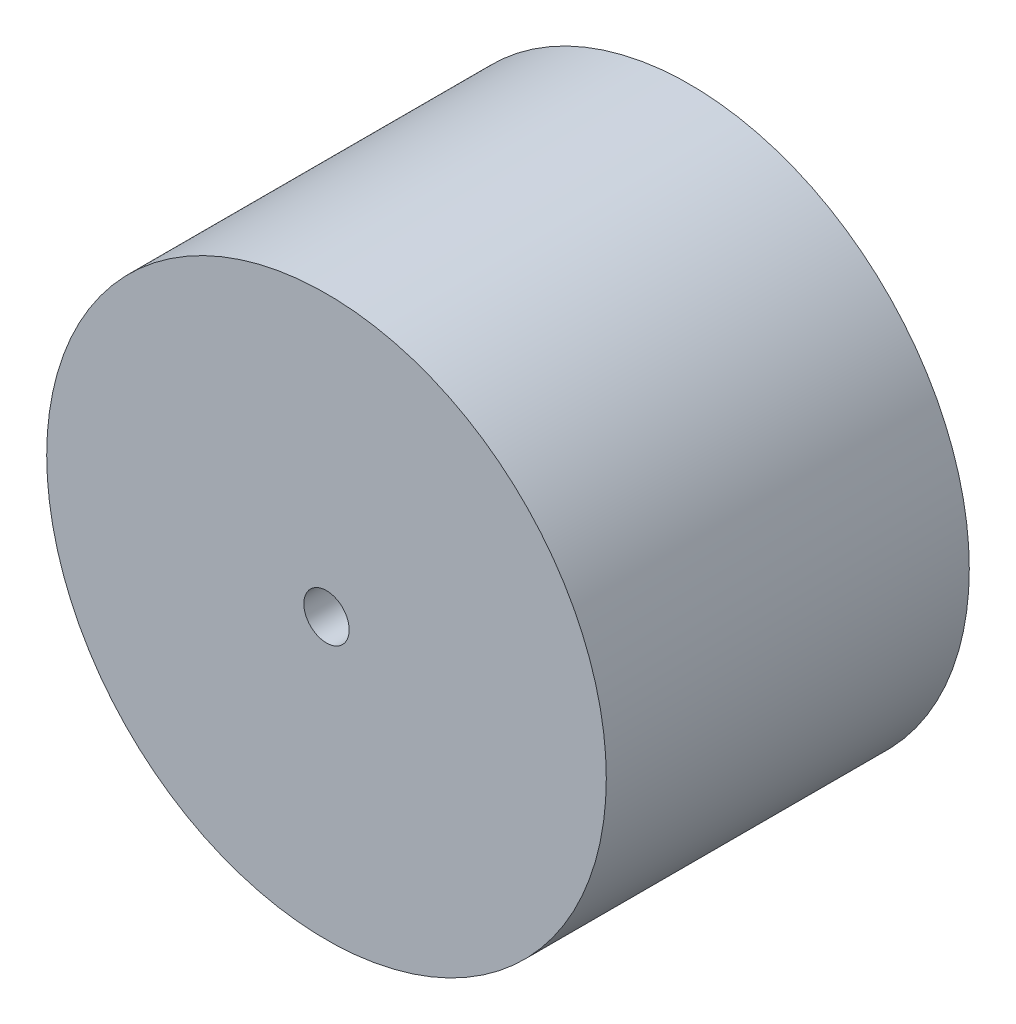
ISO-10303-21;
HEADER;
FILE_DESCRIPTION(('STEP AP214'),'2;1');
FILE_NAME('part.step','',(''),(''),'','','');
FILE_SCHEMA(('AUTOMOTIVE_DESIGN { 1 0 10303 214 1 1 1 1 }'));
ENDSEC;
DATA;
#1=APPLICATION_CONTEXT('core data for automotive mechanical design processes');
#2=APPLICATION_PROTOCOL_DEFINITION('international standard','automotive_design',2000,#1);
#3=PRODUCT_CONTEXT('',#1,'mechanical');
#4=PRODUCT('Part','Part','',(#3));
#5=PRODUCT_RELATED_PRODUCT_CATEGORY('part','',(#4));
#6=PRODUCT_DEFINITION_FORMATION('','',#4);
#7=PRODUCT_DEFINITION_CONTEXT('part definition',#1,'design');
#8=PRODUCT_DEFINITION('design','',#6,#7);
#9=PRODUCT_DEFINITION_SHAPE('','',#8);
#10=(LENGTH_UNIT() NAMED_UNIT(*) SI_UNIT(.MILLI.,.METRE.));
#11=(NAMED_UNIT(*) PLANE_ANGLE_UNIT() SI_UNIT($,.RADIAN.));
#12=(NAMED_UNIT(*) SI_UNIT($,.STERADIAN.) SOLID_ANGLE_UNIT());
#13=UNCERTAINTY_MEASURE_WITH_UNIT(LENGTH_MEASURE(1.E-05),#10,'distance_accuracy_value','');
#14=(GEOMETRIC_REPRESENTATION_CONTEXT(3) GLOBAL_UNCERTAINTY_ASSIGNED_CONTEXT((#13)) GLOBAL_UNIT_ASSIGNED_CONTEXT((#10,
#11,#12)) REPRESENTATION_CONTEXT('',''));
#15=CARTESIAN_POINT('',(0.,0.,0.));
#16=DIRECTION('',(0.,0.,1.));
#17=DIRECTION('',(1.,0.,0.));
#18=AXIS2_PLACEMENT_3D('',#15,#16,#17);
#19=CARTESIAN_POINT('',(0.,0.,24.));
#20=DIRECTION('',(0.,0.,-1.));
#21=DIRECTION('',(-1.,0.,0.));
#22=AXIS2_PLACEMENT_3D('',#19,#20,#21);
#23=CYLINDRICAL_SURFACE('',#22,18.5);
#24=CARTESIAN_POINT('',(0.,0.,24.));
#25=DIRECTION('',(0.,0.,1.));
#26=DIRECTION('',(1.,0.,0.));
#27=AXIS2_PLACEMENT_3D('',#24,#25,#26);
#28=CIRCLE('',#27,18.5);
#29=CARTESIAN_POINT('',(18.5,0.,24.));
#30=VERTEX_POINT('',#29);
#31=EDGE_CURVE('E10',#30,#30,#28,.T.);
#32=ORIENTED_EDGE('',*,*,#31,.F.);
#33=EDGE_LOOP('',(#32));
#34=FACE_BOUND('',#33,.T.);
#35=CARTESIAN_POINT('',(0.,0.,0.));
#36=DIRECTION('',(0.,0.,1.));
#37=DIRECTION('',(1.,0.,0.));
#38=AXIS2_PLACEMENT_3D('',#35,#36,#37);
#39=CIRCLE('',#38,18.5);
#40=CARTESIAN_POINT('',(18.5,0.,0.));
#41=VERTEX_POINT('',#40);
#42=EDGE_CURVE('E36',#41,#41,#39,.T.);
#43=ORIENTED_EDGE('',*,*,#42,.T.);
#44=EDGE_LOOP('',(#43));
#45=FACE_BOUND('',#44,.T.);
#46=ADVANCED_FACE('F33',(#34,#45),#23,.T.);
#47=CARTESIAN_POINT('',(0.,0.,24.));
#48=DIRECTION('',(0.,0.,1.));
#49=DIRECTION('',(1.,0.,0.));
#50=AXIS2_PLACEMENT_3D('',#47,#48,#49);
#51=PLANE('',#50);
#52=CARTESIAN_POINT('',(0.,0.,24.));
#53=DIRECTION('',(0.,0.,1.));
#54=DIRECTION('',(1.,0.,0.));
#55=AXIS2_PLACEMENT_3D('',#52,#53,#54);
#56=CIRCLE('',#55,1.5);
#57=CARTESIAN_POINT('',(1.5,0.,24.));
#58=VERTEX_POINT('',#57);
#59=EDGE_CURVE('E45',#58,#58,#56,.T.);
#60=ORIENTED_EDGE('',*,*,#59,.F.);
#61=EDGE_LOOP('',(#60));
#62=FACE_BOUND('',#61,.T.);
#63=ORIENTED_EDGE('',*,*,#31,.T.);
#64=EDGE_LOOP('',(#63));
#65=FACE_BOUND('',#64,.T.);
#66=ADVANCED_FACE('F60',(#62,#65),#51,.T.);
#67=CARTESIAN_POINT('',(0.,0.,0.));
#68=DIRECTION('',(0.,0.,1.));
#69=DIRECTION('',(1.,0.,0.));
#70=AXIS2_PLACEMENT_3D('',#67,#68,#69);
#71=PLANE('',#70);
#72=CARTESIAN_POINT('',(0.,0.,0.));
#73=DIRECTION('',(0.,0.,1.));
#74=DIRECTION('',(1.,0.,0.));
#75=AXIS2_PLACEMENT_3D('',#72,#73,#74);
#76=CIRCLE('',#75,1.5);
#77=CARTESIAN_POINT('',(1.5,0.,0.));
#78=VERTEX_POINT('',#77);
#79=EDGE_CURVE('E43',#78,#78,#76,.T.);
#80=ORIENTED_EDGE('',*,*,#79,.T.);
#81=EDGE_LOOP('',(#80));
#82=FACE_BOUND('',#81,.T.);
#83=ORIENTED_EDGE('',*,*,#42,.F.);
#84=EDGE_LOOP('',(#83));
#85=FACE_BOUND('',#84,.T.);
#86=ADVANCED_FACE('F51',(#82,#85),#71,.F.);
#87=CARTESIAN_POINT('',(0.,0.,0.));
#88=DIRECTION('',(0.,0.,1.));
#89=DIRECTION('',(1.,0.,0.));
#90=AXIS2_PLACEMENT_3D('',#87,#88,#89);
#91=CYLINDRICAL_SURFACE('',#90,1.5);
#92=ORIENTED_EDGE('',*,*,#79,.F.);
#93=EDGE_LOOP('',(#92));
#94=FACE_BOUND('',#93,.T.);
#95=ORIENTED_EDGE('',*,*,#59,.T.);
#96=EDGE_LOOP('',(#95));
#97=FACE_BOUND('',#96,.T.);
#98=ADVANCED_FACE('F54',(#94,#97),#91,.F.);
#99=CLOSED_SHELL('',(#46,#66,#86,#98));
#100=MANIFOLD_SOLID_BREP('B2',#99);
#101=ADVANCED_BREP_SHAPE_REPRESENTATION('',(#18,#100),#14);
#102=SHAPE_DEFINITION_REPRESENTATION(#9,#101);
ENDSEC;
END-ISO-10303-21;
